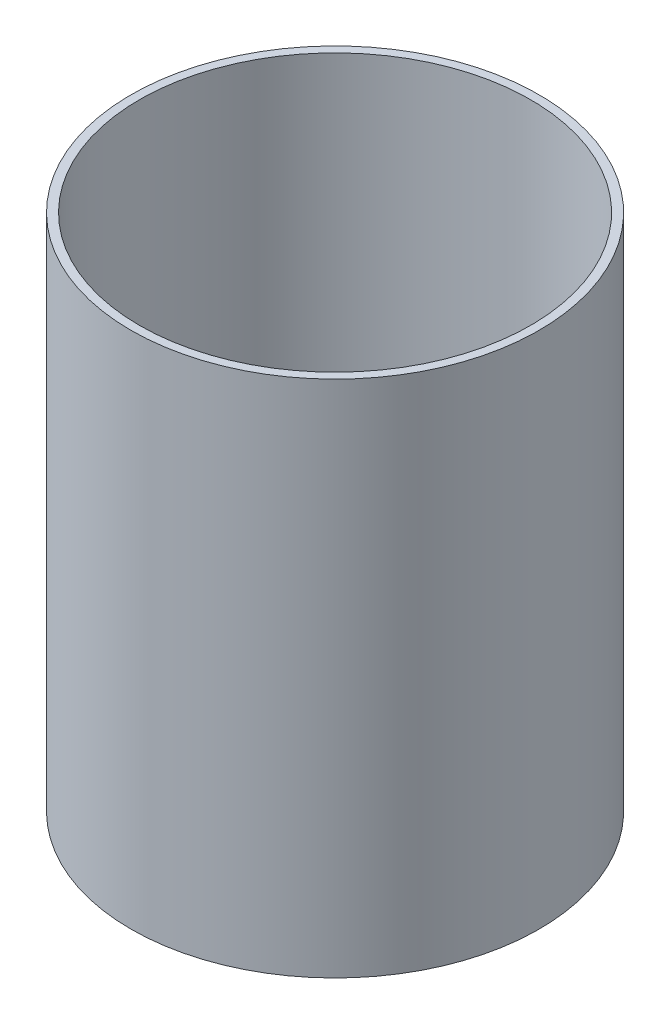
ISO-10303-21;
HEADER;
FILE_DESCRIPTION(('STEP AP214'),'2;1');
FILE_NAME('part.step','',(''),(''),'','','');
FILE_SCHEMA(('AUTOMOTIVE_DESIGN { 1 0 10303 214 1 1 1 1 }'));
ENDSEC;
DATA;
#1=APPLICATION_CONTEXT('core data for automotive mechanical design processes');
#2=APPLICATION_PROTOCOL_DEFINITION('international standard','automotive_design',2000,#1);
#3=PRODUCT_CONTEXT('',#1,'mechanical');
#4=PRODUCT('Part','Part','',(#3));
#5=PRODUCT_RELATED_PRODUCT_CATEGORY('part','',(#4));
#6=PRODUCT_DEFINITION_FORMATION('','',#4);
#7=PRODUCT_DEFINITION_CONTEXT('part definition',#1,'design');
#8=PRODUCT_DEFINITION('design','',#6,#7);
#9=PRODUCT_DEFINITION_SHAPE('','',#8);
#10=(LENGTH_UNIT() NAMED_UNIT(*) SI_UNIT(.MILLI.,.METRE.));
#11=(NAMED_UNIT(*) PLANE_ANGLE_UNIT() SI_UNIT($,.RADIAN.));
#12=(NAMED_UNIT(*) SI_UNIT($,.STERADIAN.) SOLID_ANGLE_UNIT());
#13=UNCERTAINTY_MEASURE_WITH_UNIT(LENGTH_MEASURE(1.E-05),#10,'distance_accuracy_value','');
#14=(GEOMETRIC_REPRESENTATION_CONTEXT(3) GLOBAL_UNCERTAINTY_ASSIGNED_CONTEXT((#13)) GLOBAL_UNIT_ASSIGNED_CONTEXT((#10,
#11,#12)) REPRESENTATION_CONTEXT('',''));
#15=CARTESIAN_POINT('',(0.,0.,0.));
#16=DIRECTION('',(0.,0.,1.));
#17=DIRECTION('',(1.,0.,0.));
#18=AXIS2_PLACEMENT_3D('',#15,#16,#17);
#19=CARTESIAN_POINT('',(0.,193.675,0.));
#20=DIRECTION('',(0.,1.,0.));
#21=DIRECTION('',(0.,0.,1.));
#22=AXIS2_PLACEMENT_3D('',#19,#20,#21);
#23=PLANE('',#22);
#24=CARTESIAN_POINT('',(0.,193.675,0.));
#25=DIRECTION('',(0.,1.,0.));
#26=DIRECTION('',(0.,0.,1.));
#27=AXIS2_PLACEMENT_3D('',#24,#25,#26);
#28=CIRCLE('',#27,76.2);
#29=CARTESIAN_POINT('',(0.,193.675,76.2));
#30=VERTEX_POINT('',#29);
#31=EDGE_CURVE('E10',#30,#30,#28,.T.);
#32=ORIENTED_EDGE('',*,*,#31,.T.);
#33=EDGE_LOOP('',(#32));
#34=FACE_BOUND('',#33,.T.);
#35=CARTESIAN_POINT('',(0.,193.675,0.));
#36=DIRECTION('',(0.,1.,0.));
#37=DIRECTION('',(0.,0.,1.));
#38=AXIS2_PLACEMENT_3D('',#35,#36,#37);
#39=CIRCLE('',#38,73.025);
#40=CARTESIAN_POINT('',(0.,193.675,73.025));
#41=VERTEX_POINT('',#40);
#42=EDGE_CURVE('E46',#41,#41,#39,.T.);
#43=ORIENTED_EDGE('',*,*,#42,.F.);
#44=EDGE_LOOP('',(#43));
#45=FACE_BOUND('',#44,.T.);
#46=ADVANCED_FACE('F35',(#34,#45),#23,.T.);
#47=CARTESIAN_POINT('',(0.,0.,0.));
#48=DIRECTION('',(0.,1.,0.));
#49=DIRECTION('',(0.,0.,1.));
#50=AXIS2_PLACEMENT_3D('',#47,#48,#49);
#51=PLANE('',#50);
#52=CARTESIAN_POINT('',(0.,0.,0.));
#53=DIRECTION('',(0.,1.,0.));
#54=DIRECTION('',(0.,0.,1.));
#55=AXIS2_PLACEMENT_3D('',#52,#53,#54);
#56=CIRCLE('',#55,76.2);
#57=CARTESIAN_POINT('',(0.,0.,76.2));
#58=VERTEX_POINT('',#57);
#59=EDGE_CURVE('E39',#58,#58,#56,.T.);
#60=ORIENTED_EDGE('',*,*,#59,.F.);
#61=EDGE_LOOP('',(#60));
#62=FACE_BOUND('',#61,.T.);
#63=CARTESIAN_POINT('',(0.,0.,0.));
#64=DIRECTION('',(0.,1.,0.));
#65=DIRECTION('',(0.,0.,1.));
#66=AXIS2_PLACEMENT_3D('',#63,#64,#65);
#67=CIRCLE('',#66,73.025);
#68=CARTESIAN_POINT('',(0.,0.,73.025));
#69=VERTEX_POINT('',#68);
#70=EDGE_CURVE('E48',#69,#69,#67,.T.);
#71=ORIENTED_EDGE('',*,*,#70,.T.);
#72=EDGE_LOOP('',(#71));
#73=FACE_BOUND('',#72,.T.);
#74=ADVANCED_FACE('F58',(#62,#73),#51,.F.);
#75=CARTESIAN_POINT('',(0.,193.675,0.));
#76=DIRECTION('',(0.,-1.,0.));
#77=DIRECTION('',(0.,0.,-1.));
#78=AXIS2_PLACEMENT_3D('',#75,#76,#77);
#79=CYLINDRICAL_SURFACE('',#78,76.2);
#80=ORIENTED_EDGE('',*,*,#31,.F.);
#81=EDGE_LOOP('',(#80));
#82=FACE_BOUND('',#81,.T.);
#83=ORIENTED_EDGE('',*,*,#59,.T.);
#84=EDGE_LOOP('',(#83));
#85=FACE_BOUND('',#84,.T.);
#86=ADVANCED_FACE('F37',(#82,#85),#79,.T.);
#87=CARTESIAN_POINT('',(0.,193.675,0.));
#88=DIRECTION('',(0.,-1.,0.));
#89=DIRECTION('',(0.,0.,-1.));
#90=AXIS2_PLACEMENT_3D('',#87,#88,#89);
#91=CYLINDRICAL_SURFACE('',#90,73.025);
#92=ORIENTED_EDGE('',*,*,#42,.T.);
#93=EDGE_LOOP('',(#92));
#94=FACE_BOUND('',#93,.T.);
#95=ORIENTED_EDGE('',*,*,#70,.F.);
#96=EDGE_LOOP('',(#95));
#97=FACE_BOUND('',#96,.T.);
#98=ADVANCED_FACE('F54',(#94,#97),#91,.F.);
#99=CLOSED_SHELL('',(#46,#74,#86,#98));
#100=MANIFOLD_SOLID_BREP('B2',#99);
#101=ADVANCED_BREP_SHAPE_REPRESENTATION('',(#18,#100),#14);
#102=SHAPE_DEFINITION_REPRESENTATION(#9,#101);
ENDSEC;
END-ISO-10303-21;
